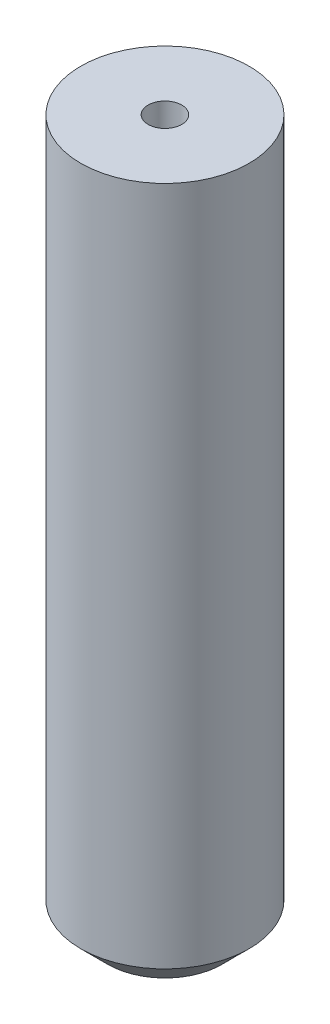
ISO-10303-21;
HEADER;
FILE_DESCRIPTION(('STEP AP214'),'2;1');
FILE_NAME('part.step','',(''),(''),'','','');
FILE_SCHEMA(('AUTOMOTIVE_DESIGN { 1 0 10303 214 1 1 1 1 }'));
ENDSEC;
DATA;
#1=APPLICATION_CONTEXT('core data for automotive mechanical design processes');
#2=APPLICATION_PROTOCOL_DEFINITION('international standard','automotive_design',2000,#1);
#3=PRODUCT_CONTEXT('',#1,'mechanical');
#4=PRODUCT('Part','Part','',(#3));
#5=PRODUCT_RELATED_PRODUCT_CATEGORY('part','',(#4));
#6=PRODUCT_DEFINITION_FORMATION('','',#4);
#7=PRODUCT_DEFINITION_CONTEXT('part definition',#1,'design');
#8=PRODUCT_DEFINITION('design','',#6,#7);
#9=PRODUCT_DEFINITION_SHAPE('','',#8);
#10=(LENGTH_UNIT() NAMED_UNIT(*) SI_UNIT(.MILLI.,.METRE.));
#11=(NAMED_UNIT(*) PLANE_ANGLE_UNIT() SI_UNIT($,.RADIAN.));
#12=(NAMED_UNIT(*) SI_UNIT($,.STERADIAN.) SOLID_ANGLE_UNIT());
#13=UNCERTAINTY_MEASURE_WITH_UNIT(LENGTH_MEASURE(1.E-05),#10,'distance_accuracy_value','');
#14=(GEOMETRIC_REPRESENTATION_CONTEXT(3) GLOBAL_UNCERTAINTY_ASSIGNED_CONTEXT((#13)) GLOBAL_UNIT_ASSIGNED_CONTEXT((#10,
#11,#12)) REPRESENTATION_CONTEXT('',''));
#15=CARTESIAN_POINT('',(0.,0.,0.));
#16=DIRECTION('',(0.,0.,1.));
#17=DIRECTION('',(1.,0.,0.));
#18=AXIS2_PLACEMENT_3D('',#15,#16,#17);
#19=CARTESIAN_POINT('',(0.,105.,0.));
#20=DIRECTION('',(0.,-1.,0.));
#21=DIRECTION('',(0.,0.,-1.));
#22=AXIS2_PLACEMENT_3D('',#19,#20,#21);
#23=CYLINDRICAL_SURFACE('',#22,12.5);
#24=CARTESIAN_POINT('',(0.,3.99999999999998,0.));
#25=DIRECTION('',(0.,1.,0.));
#26=DIRECTION('',(0.,0.,1.));
#27=AXIS2_PLACEMENT_3D('',#24,#25,#26);
#28=CIRCLE('',#27,12.5);
#29=CARTESIAN_POINT('',(0.,3.99999999999998,12.5));
#30=VERTEX_POINT('',#29);
#31=EDGE_CURVE('E54',#30,#30,#28,.T.);
#32=ORIENTED_EDGE('',*,*,#31,.T.);
#33=EDGE_LOOP('',(#32));
#34=FACE_BOUND('',#33,.T.);
#35=CARTESIAN_POINT('',(0.,105.,0.));
#36=DIRECTION('',(0.,1.,0.));
#37=DIRECTION('',(0.,0.,1.));
#38=AXIS2_PLACEMENT_3D('',#35,#36,#37);
#39=CIRCLE('',#38,12.5);
#40=CARTESIAN_POINT('',(0.,105.,12.5));
#41=VERTEX_POINT('',#40);
#42=EDGE_CURVE('E59',#41,#41,#39,.T.);
#43=ORIENTED_EDGE('',*,*,#42,.F.);
#44=EDGE_LOOP('',(#43));
#45=FACE_BOUND('',#44,.T.);
#46=ADVANCED_FACE('F45',(#34,#45),#23,.T.);
#47=CARTESIAN_POINT('',(0.,105.,0.));
#48=DIRECTION('',(0.,1.,0.));
#49=DIRECTION('',(0.,0.,1.));
#50=AXIS2_PLACEMENT_3D('',#47,#48,#49);
#51=PLANE('',#50);
#52=CARTESIAN_POINT('',(0.,105.,0.));
#53=DIRECTION('',(0.,1.,0.));
#54=DIRECTION('',(0.,0.,1.));
#55=AXIS2_PLACEMENT_3D('',#52,#53,#54);
#56=CIRCLE('',#55,2.5);
#57=CARTESIAN_POINT('',(0.,105.,2.5));
#58=VERTEX_POINT('',#57);
#59=EDGE_CURVE('E67',#58,#58,#56,.T.);
#60=ORIENTED_EDGE('',*,*,#59,.F.);
#61=EDGE_LOOP('',(#60));
#62=FACE_BOUND('',#61,.T.);
#63=ORIENTED_EDGE('',*,*,#42,.T.);
#64=EDGE_LOOP('',(#63));
#65=FACE_BOUND('',#64,.T.);
#66=ADVANCED_FACE('F83',(#62,#65),#51,.T.);
#67=CARTESIAN_POINT('',(0.,0.,0.));
#68=DIRECTION('',(0.,1.,0.));
#69=DIRECTION('',(0.,0.,1.));
#70=AXIS2_PLACEMENT_3D('',#67,#68,#69);
#71=PLANE('',#70);
#72=CARTESIAN_POINT('',(0.,0.,0.));
#73=DIRECTION('',(0.,1.,0.));
#74=DIRECTION('',(0.,0.,1.));
#75=AXIS2_PLACEMENT_3D('',#72,#73,#74);
#76=CIRCLE('',#75,8.50000000000001);
#77=CARTESIAN_POINT('',(0.,0.,8.50000000000001));
#78=VERTEX_POINT('',#77);
#79=EDGE_CURVE('E10',#78,#78,#76,.F.);
#80=ORIENTED_EDGE('',*,*,#79,.T.);
#81=EDGE_LOOP('',(#80));
#82=FACE_BOUND('',#81,.T.);
#83=CARTESIAN_POINT('',(0.,0.,0.));
#84=DIRECTION('',(0.,1.,0.));
#85=DIRECTION('',(0.,0.,1.));
#86=AXIS2_PLACEMENT_3D('',#83,#84,#85);
#87=CIRCLE('',#86,2.5);
#88=CARTESIAN_POINT('',(0.,0.,2.5));
#89=VERTEX_POINT('',#88);
#90=EDGE_CURVE('E64',#89,#89,#87,.T.);
#91=ORIENTED_EDGE('',*,*,#90,.T.);
#92=EDGE_LOOP('',(#91));
#93=FACE_BOUND('',#92,.T.);
#94=ADVANCED_FACE('F75',(#82,#93),#71,.F.);
#95=CARTESIAN_POINT('',(0.,0.,0.));
#96=DIRECTION('',(0.,1.,0.));
#97=DIRECTION('',(0.,0.,1.));
#98=AXIS2_PLACEMENT_3D('',#95,#96,#97);
#99=CYLINDRICAL_SURFACE('',#98,2.5);
#100=ORIENTED_EDGE('',*,*,#90,.F.);
#101=EDGE_LOOP('',(#100));
#102=FACE_BOUND('',#101,.T.);
#103=ORIENTED_EDGE('',*,*,#59,.T.);
#104=EDGE_LOOP('',(#103));
#105=FACE_BOUND('',#104,.T.);
#106=ADVANCED_FACE('F77',(#102,#105),#99,.F.);
#107=CARTESIAN_POINT('',(0.,3.99999999999998,0.));
#108=DIRECTION('',(0.,1.,0.));
#109=DIRECTION('',(0.,0.,1.));
#110=AXIS2_PLACEMENT_3D('',#107,#108,#109);
#111=CONICAL_SURFACE('',#110,12.5,0.78539816339745);
#112=ORIENTED_EDGE('',*,*,#79,.F.);
#113=EDGE_LOOP('',(#112));
#114=FACE_BOUND('',#113,.T.);
#115=ORIENTED_EDGE('',*,*,#31,.F.);
#116=EDGE_LOOP('',(#115));
#117=FACE_BOUND('',#116,.T.);
#118=ADVANCED_FACE('F48',(#114,#117),#111,.T.);
#119=CLOSED_SHELL('',(#46,#66,#94,#106,#118));
#120=MANIFOLD_SOLID_BREP('B2',#119);
#121=ADVANCED_BREP_SHAPE_REPRESENTATION('',(#18,#120),#14);
#122=SHAPE_DEFINITION_REPRESENTATION(#9,#121);
ENDSEC;
END-ISO-10303-21;
